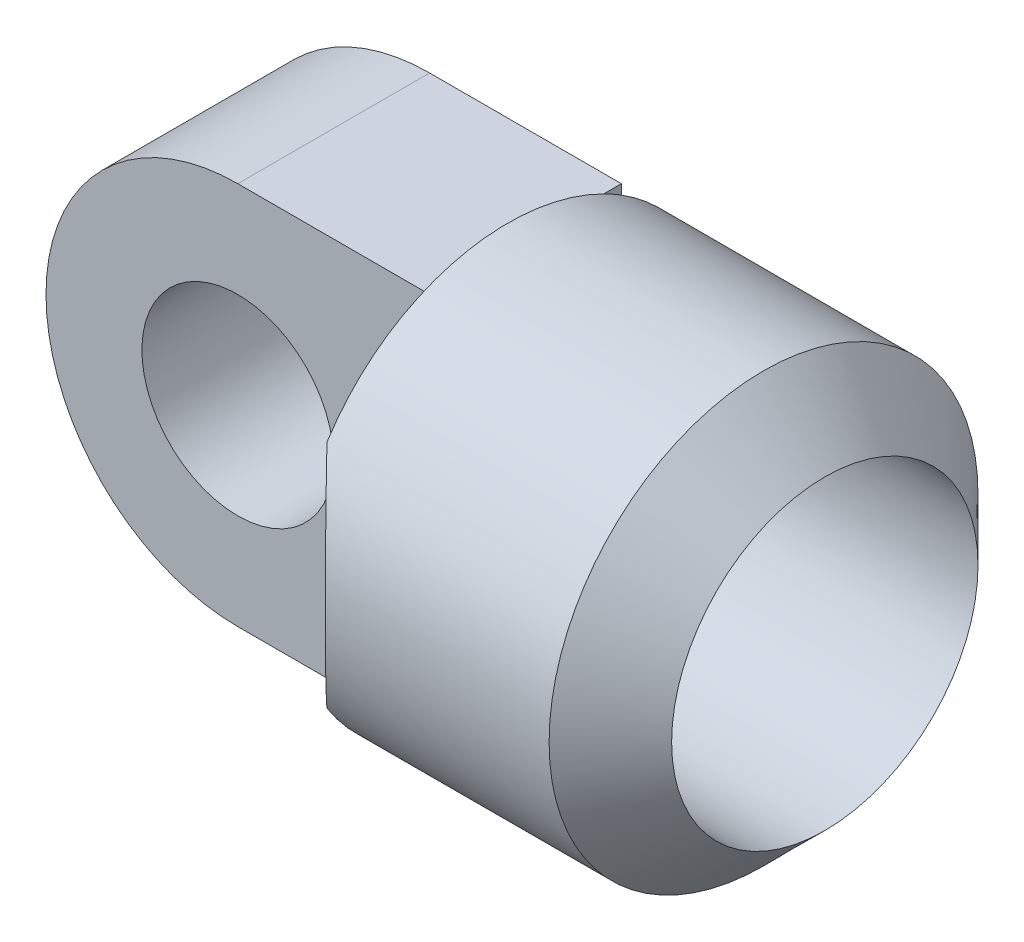
ISO-10303-21;
HEADER;
FILE_DESCRIPTION(('STEP AP214'),'2;1');
FILE_NAME('part.step','',(''),(''),'','','');
FILE_SCHEMA(('AUTOMOTIVE_DESIGN { 1 0 10303 214 1 1 1 1 }'));
ENDSEC;
DATA;
#1=APPLICATION_CONTEXT('core data for automotive mechanical design processes');
#2=APPLICATION_PROTOCOL_DEFINITION('international standard','automotive_design',2000,#1);
#3=PRODUCT_CONTEXT('',#1,'mechanical');
#4=PRODUCT('Part','Part','',(#3));
#5=PRODUCT_RELATED_PRODUCT_CATEGORY('part','',(#4));
#6=PRODUCT_DEFINITION_FORMATION('','',#4);
#7=PRODUCT_DEFINITION_CONTEXT('part definition',#1,'design');
#8=PRODUCT_DEFINITION('design','',#6,#7);
#9=PRODUCT_DEFINITION_SHAPE('','',#8);
#10=(LENGTH_UNIT() NAMED_UNIT(*) SI_UNIT(.MILLI.,.METRE.));
#11=(NAMED_UNIT(*) PLANE_ANGLE_UNIT() SI_UNIT($,.RADIAN.));
#12=(NAMED_UNIT(*) SI_UNIT($,.STERADIAN.) SOLID_ANGLE_UNIT());
#13=UNCERTAINTY_MEASURE_WITH_UNIT(LENGTH_MEASURE(1.E-05),#10,'distance_accuracy_value','');
#14=(GEOMETRIC_REPRESENTATION_CONTEXT(3) GLOBAL_UNCERTAINTY_ASSIGNED_CONTEXT((#13)) GLOBAL_UNIT_ASSIGNED_CONTEXT((#10,
#11,#12)) REPRESENTATION_CONTEXT('',''));
#15=CARTESIAN_POINT('',(0.,0.,0.));
#16=DIRECTION('',(0.,0.,1.));
#17=DIRECTION('',(1.,0.,0.));
#18=AXIS2_PLACEMENT_3D('',#15,#16,#17);
#19=CARTESIAN_POINT('',(-7.99719,0.,-5.73077001430538));
#20=DIRECTION('',(0.,0.,1.));
#21=DIRECTION('',(0.,-1.,0.));
#22=AXIS2_PLACEMENT_3D('',#19,#20,#21);
#23=CYLINDRICAL_SURFACE('',#22,4.8387);
#24=CARTESIAN_POINT('',(-7.99719,0.,3.94662998569462));
#25=DIRECTION('',(0.,0.,1.));
#26=DIRECTION('',(0.,-1.,0.));
#27=AXIS2_PLACEMENT_3D('',#24,#25,#26);
#28=CIRCLE('',#27,4.8387);
#29=CARTESIAN_POINT('',(-7.99719,-4.83870000000005,3.94662998569462));
#30=VERTEX_POINT('',#29);
#31=EDGE_CURVE('E106',#30,#30,#28,.F.);
#32=ORIENTED_EDGE('',*,*,#31,.F.);
#33=EDGE_LOOP('',(#32));
#34=FACE_BOUND('',#33,.T.);
#35=CARTESIAN_POINT('',(-7.99719,0.,-5.73077001430538));
#36=DIRECTION('',(0.,0.,1.));
#37=DIRECTION('',(0.,-1.,0.));
#38=AXIS2_PLACEMENT_3D('',#35,#36,#37);
#39=CIRCLE('',#38,4.8387);
#40=CARTESIAN_POINT('',(-7.99719,-4.83870000000005,-5.73077001430538));
#41=VERTEX_POINT('',#40);
#42=EDGE_CURVE('E19',#41,#41,#39,.F.);
#43=ORIENTED_EDGE('',*,*,#42,.T.);
#44=EDGE_LOOP('',(#43));
#45=FACE_BOUND('',#44,.T.);
#46=ADVANCED_FACE('F16',(#34,#45),#23,.F.);
#47=CARTESIAN_POINT('',(-7.99719,0.,-5.73077001430538));
#48=DIRECTION('',(0.,0.,1.));
#49=DIRECTION('',(0.,-1.,0.));
#50=AXIS2_PLACEMENT_3D('',#47,#48,#49);
#51=CYLINDRICAL_SURFACE('',#50,9.6774);
#52=CARTESIAN_POINT('',(-7.99719,0.,-5.73077001430538));
#53=DIRECTION('',(0.,0.,1.));
#54=DIRECTION('',(0.,-1.,0.));
#55=AXIS2_PLACEMENT_3D('',#52,#53,#54);
#56=CIRCLE('',#55,9.6774);
#57=CARTESIAN_POINT('',(-7.99719,9.67739999999996,-5.73077001430538));
#58=VERTEX_POINT('',#57);
#59=CARTESIAN_POINT('',(-7.99718999999999,-9.67740000000005,-5.73077001430538));
#60=VERTEX_POINT('',#59);
#61=EDGE_CURVE('E85',#58,#60,#56,.T.);
#62=ORIENTED_EDGE('',*,*,#61,.T.);
#63=DIRECTION('',(0.,0.,1.));
#64=VECTOR('',#63,1.);
#65=CARTESIAN_POINT('',(-7.99719,-9.67740000000005,-5.73077001430538));
#66=LINE('',#65,#64);
#67=CARTESIAN_POINT('',(-7.99718999999999,-9.67740000000005,3.94662998569462));
#68=VERTEX_POINT('',#67);
#69=EDGE_CURVE('E125',#68,#60,#66,.F.);
#70=ORIENTED_EDGE('',*,*,#69,.F.);
#71=CARTESIAN_POINT('',(-7.99719,0.,3.94662998569462));
#72=DIRECTION('',(0.,0.,1.));
#73=DIRECTION('',(0.,-1.,0.));
#74=AXIS2_PLACEMENT_3D('',#71,#72,#73);
#75=CIRCLE('',#74,9.6774);
#76=CARTESIAN_POINT('',(-7.99719,9.67739999999997,3.94662998569462));
#77=VERTEX_POINT('',#76);
#78=EDGE_CURVE('E102',#77,#68,#75,.T.);
#79=ORIENTED_EDGE('',*,*,#78,.F.);
#80=DIRECTION('',(0.,0.,1.));
#81=VECTOR('',#80,1.);
#82=CARTESIAN_POINT('',(-7.99719,9.67739999999996,-5.73077001430538));
#83=LINE('',#82,#81);
#84=EDGE_CURVE('E100',#58,#77,#83,.T.);
#85=ORIENTED_EDGE('',*,*,#84,.F.);
#86=EDGE_LOOP('',(#62,#70,#79,#85));
#87=FACE_BOUND('',#86,.T.);
#88=ADVANCED_FACE('F101',(#87),#51,.T.);
#89=CARTESIAN_POINT('',(-6.37543953619316,0.,-5.73077001430538));
#90=DIRECTION('',(0.,0.,1.));
#91=DIRECTION('',(0.,-1.,0.));
#92=AXIS2_PLACEMENT_3D('',#89,#90,#91);
#93=PLANE('',#92);
#94=DIRECTION('',(0.,1.,0.));
#95=VECTOR('',#94,1.);
#96=CARTESIAN_POINT('',(1.68021000000001,9.67739999999998,-5.73077001430538));
#97=LINE('',#96,#95);
#98=CARTESIAN_POINT('',(1.68020999999995,-9.67740000000004,-5.73077001430538));
#99=VERTEX_POINT('',#98);
#100=CARTESIAN_POINT('',(1.68021,-9.17819869054592,-5.73077001430538));
#101=VERTEX_POINT('',#100);
#102=EDGE_CURVE('E264',#99,#101,#97,.T.);
#103=ORIENTED_EDGE('',*,*,#102,.F.);
#104=DIRECTION('',(1.,0.,0.));
#105=VECTOR('',#104,1.);
#106=CARTESIAN_POINT('',(1.68020999999992,-9.67740000000004,-5.73077001430538));
#107=LINE('',#106,#105);
#108=EDGE_CURVE('E94',#60,#99,#107,.T.);
#109=ORIENTED_EDGE('',*,*,#108,.F.);
#110=ORIENTED_EDGE('',*,*,#61,.F.);
#111=DIRECTION('',(1.,0.,0.));
#112=VECTOR('',#111,1.);
#113=CARTESIAN_POINT('',(-7.99719,9.67739999999996,-5.73077001430538));
#114=LINE('',#113,#112);
#115=CARTESIAN_POINT('',(1.68021000000001,9.67739999999998,-5.73077001430538));
#116=VERTEX_POINT('',#115);
#117=EDGE_CURVE('E91',#116,#58,#114,.F.);
#118=ORIENTED_EDGE('',*,*,#117,.F.);
#119=DIRECTION('',(0.,-1.,0.));
#120=VECTOR('',#119,1.);
#121=CARTESIAN_POINT('',(1.68021000000001,0.,-5.73077001430538));
#122=LINE('',#121,#120);
#123=CARTESIAN_POINT('',(1.68020999999996,9.17819869054587,-5.73077001430538));
#124=VERTEX_POINT('',#123);
#125=EDGE_CURVE('E98',#124,#116,#122,.F.);
#126=ORIENTED_EDGE('',*,*,#125,.F.);
#127=DIRECTION('',(0.,1.,0.));
#128=VECTOR('',#127,1.);
#129=CARTESIAN_POINT('',(1.68021000000001,5.41019999999998,-5.73077001430538));
#130=LINE('',#129,#128);
#131=CARTESIAN_POINT('',(1.68021000000001,5.81539365219581,-5.73077001430538));
#132=VERTEX_POINT('',#131);
#133=EDGE_CURVE('E253',#132,#124,#130,.T.);
#134=ORIENTED_EDGE('',*,*,#133,.F.);
#135=CARTESIAN_POINT('',(-7.99719,0.,-5.73077001430538));
#136=DIRECTION('',(0.,0.,1.));
#137=DIRECTION('',(0.,-1.,0.));
#138=AXIS2_PLACEMENT_3D('',#135,#136,#137);
#139=CIRCLE('',#138,11.2903);
#140=CARTESIAN_POINT('',(1.68021000000001,-5.81539365219591,-5.73077001430538));
#141=VERTEX_POINT('',#140);
#142=EDGE_CURVE('E216',#132,#141,#139,.F.);
#143=ORIENTED_EDGE('',*,*,#142,.T.);
#144=DIRECTION('',(0.,1.,0.));
#145=VECTOR('',#144,1.);
#146=CARTESIAN_POINT('',(1.68021000000001,5.41019999999998,-5.73077001430538));
#147=LINE('',#146,#145);
#148=EDGE_CURVE('E219',#101,#141,#147,.T.);
#149=ORIENTED_EDGE('',*,*,#148,.F.);
#150=EDGE_LOOP('',(#103,#109,#110,#118,#126,#134,#143,#149));
#151=FACE_BOUND('',#150,.T.);
#152=ORIENTED_EDGE('',*,*,#42,.F.);
#153=EDGE_LOOP('',(#152));
#154=FACE_BOUND('',#153,.T.);
#155=ADVANCED_FACE('F88',(#151,#154),#93,.F.);
#156=CARTESIAN_POINT('',(4.90600999999998,3.86460999999999,0.));
#157=DIRECTION('',(1.,0.,0.));
#158=DIRECTION('',(0.,1.,0.));
#159=AXIS2_PLACEMENT_3D('',#156,#157,#158);
#160=PLANE('',#159);
#161=CARTESIAN_POINT('',(4.90600999999998,0.,0.));
#162=DIRECTION('',(1.,0.,0.));
#163=DIRECTION('',(0.,0.,-1.));
#164=AXIS2_PLACEMENT_3D('',#161,#162,#163);
#165=CIRCLE('',#164,7.72922000000001);
#166=CARTESIAN_POINT('',(4.90600999999998,0.,-7.72922000000001));
#167=VERTEX_POINT('',#166);
#168=EDGE_CURVE('E220',#167,#167,#165,.F.);
#169=ORIENTED_EDGE('',*,*,#168,.F.);
#170=EDGE_LOOP('',(#169));
#171=FACE_BOUND('',#170,.T.);
#172=ADVANCED_FACE('F192',(#171),#160,.T.);
#173=CARTESIAN_POINT('',(-7.99719,9.67739999999996,-5.73077001430538));
#174=DIRECTION('',(0.,1.,0.));
#175=DIRECTION('',(0.,0.,1.));
#176=AXIS2_PLACEMENT_3D('',#173,#174,#175);
#177=PLANE('',#176);
#178=ORIENTED_EDGE('',*,*,#117,.T.);
#179=ORIENTED_EDGE('',*,*,#84,.T.);
#180=DIRECTION('',(1.,0.,0.));
#181=VECTOR('',#180,1.);
#182=CARTESIAN_POINT('',(-6.37543953619316,9.67739999999998,3.94662998569462));
#183=LINE('',#182,#181);
#184=CARTESIAN_POINT('',(1.68021000000001,9.67739999999997,3.94662998569462));
#185=VERTEX_POINT('',#184);
#186=EDGE_CURVE('E211',#185,#77,#183,.F.);
#187=ORIENTED_EDGE('',*,*,#186,.F.);
#188=DIRECTION('',(0.,0.,1.));
#189=VECTOR('',#188,1.);
#190=CARTESIAN_POINT('',(1.68021000000001,9.67739999999996,0.));
#191=LINE('',#190,#189);
#192=CARTESIAN_POINT('',(1.68021000000001,9.67739999999997,-4.84034971877036));
#193=VERTEX_POINT('',#192);
#194=EDGE_CURVE('E223',#193,#185,#191,.T.);
#195=ORIENTED_EDGE('',*,*,#194,.F.);
#196=DIRECTION('',(0.,0.,1.));
#197=VECTOR('',#196,1.);
#198=CARTESIAN_POINT('',(1.68021000000001,9.67739999999998,-5.73077001430538));
#199=LINE('',#198,#197);
#200=EDGE_CURVE('E111',#116,#193,#199,.T.);
#201=ORIENTED_EDGE('',*,*,#200,.F.);
#202=EDGE_LOOP('',(#178,#179,#187,#195,#201));
#203=FACE_BOUND('',#202,.T.);
#204=ADVANCED_FACE('F108',(#203),#177,.T.);
#205=CARTESIAN_POINT('',(-6.37543953619316,0.,3.94662998569462));
#206=DIRECTION('',(0.,0.,1.));
#207=DIRECTION('',(0.,-1.,0.));
#208=AXIS2_PLACEMENT_3D('',#205,#206,#207);
#209=PLANE('',#208);
#210=DIRECTION('',(0.,1.,0.));
#211=VECTOR('',#210,1.);
#212=CARTESIAN_POINT('',(1.68021000000001,5.41019999999998,3.94662998569462));
#213=LINE('',#212,#211);
#214=CARTESIAN_POINT('',(1.68021000000001,-5.81539365219592,3.94662998569462));
#215=VERTEX_POINT('',#214);
#216=CARTESIAN_POINT('',(1.68021000000001,-9.67740000000004,3.94662998569462));
#217=VERTEX_POINT('',#216);
#218=EDGE_CURVE('E233',#215,#217,#213,.F.);
#219=ORIENTED_EDGE('',*,*,#218,.F.);
#220=CARTESIAN_POINT('',(-7.99719,0.,3.94662998569462));
#221=DIRECTION('',(0.,0.,1.));
#222=DIRECTION('',(0.,-1.,0.));
#223=AXIS2_PLACEMENT_3D('',#220,#221,#222);
#224=CIRCLE('',#223,11.2903);
#225=CARTESIAN_POINT('',(1.68021000000001,5.81539365219582,3.94662998569462));
#226=VERTEX_POINT('',#225);
#227=EDGE_CURVE('E224',#215,#226,#224,.T.);
#228=ORIENTED_EDGE('',*,*,#227,.T.);
#229=DIRECTION('',(0.,1.,0.));
#230=VECTOR('',#229,1.);
#231=CARTESIAN_POINT('',(1.68021000000001,5.41019999999998,3.94662998569462));
#232=LINE('',#231,#230);
#233=EDGE_CURVE('E226',#185,#226,#232,.F.);
#234=ORIENTED_EDGE('',*,*,#233,.F.);
#235=ORIENTED_EDGE('',*,*,#186,.T.);
#236=ORIENTED_EDGE('',*,*,#78,.T.);
#237=DIRECTION('',(1.,0.,0.));
#238=VECTOR('',#237,1.);
#239=CARTESIAN_POINT('',(1.68020999999992,-9.67740000000004,3.94662998569462));
#240=LINE('',#239,#238);
#241=EDGE_CURVE('E128',#217,#68,#240,.F.);
#242=ORIENTED_EDGE('',*,*,#241,.F.);
#243=EDGE_LOOP('',(#219,#228,#234,#235,#236,#242));
#244=FACE_BOUND('',#243,.T.);
#245=ORIENTED_EDGE('',*,*,#31,.T.);
#246=EDGE_LOOP('',(#245));
#247=FACE_BOUND('',#246,.T.);
#248=ADVANCED_FACE('F185',(#244,#247),#209,.T.);
#249=CARTESIAN_POINT('',(1.68020999999992,-9.67740000000004,-5.73077001430538));
#250=DIRECTION('',(0.,-1.,0.));
#251=DIRECTION('',(1.,0.,0.));
#252=AXIS2_PLACEMENT_3D('',#249,#250,#251);
#253=PLANE('',#252);
#254=DIRECTION('',(0.,0.,1.));
#255=VECTOR('',#254,1.);
#256=CARTESIAN_POINT('',(1.68020999999996,-9.67740000000004,-5.73077001430538));
#257=LINE('',#256,#255);
#258=CARTESIAN_POINT('',(1.68020999999999,-9.67740000000004,-4.84034971877031));
#259=VERTEX_POINT('',#258);
#260=EDGE_CURVE('E124',#259,#99,#257,.F.);
#261=ORIENTED_EDGE('',*,*,#260,.F.);
#262=DIRECTION('',(0.,0.,1.));
#263=VECTOR('',#262,1.);
#264=CARTESIAN_POINT('',(1.68021000000001,-9.67740000000004,0.));
#265=LINE('',#264,#263);
#266=EDGE_CURVE('E229',#217,#259,#265,.F.);
#267=ORIENTED_EDGE('',*,*,#266,.F.);
#268=ORIENTED_EDGE('',*,*,#241,.T.);
#269=ORIENTED_EDGE('',*,*,#69,.T.);
#270=ORIENTED_EDGE('',*,*,#108,.T.);
#271=EDGE_LOOP('',(#261,#267,#268,#269,#270));
#272=FACE_BOUND('',#271,.T.);
#273=ADVANCED_FACE('F181',(#272),#253,.T.);
#274=CARTESIAN_POINT('',(1.68021000000001,9.67739999999998,-5.73077001430538));
#275=DIRECTION('',(1.,0.,0.));
#276=DIRECTION('',(0.,1.,0.));
#277=AXIS2_PLACEMENT_3D('',#274,#275,#276);
#278=PLANE('',#277);
#279=ORIENTED_EDGE('',*,*,#260,.T.);
#280=ORIENTED_EDGE('',*,*,#102,.T.);
#281=CARTESIAN_POINT('',(1.68021000000001,0.,0.));
#282=DIRECTION('',(1.,0.,0.));
#283=DIRECTION('',(0.,0.,-1.));
#284=AXIS2_PLACEMENT_3D('',#281,#282,#283);
#285=CIRCLE('',#284,10.8204);
#286=EDGE_CURVE('E227',#259,#101,#285,.T.);
#287=ORIENTED_EDGE('',*,*,#286,.F.);
#288=EDGE_LOOP('',(#279,#280,#287));
#289=FACE_BOUND('',#288,.T.);
#290=ADVANCED_FACE('F177',(#289),#278,.T.);
#291=CARTESIAN_POINT('',(1.68021000000001,5.41019999999998,0.));
#292=DIRECTION('',(-1.,0.,0.));
#293=DIRECTION('',(0.,0.,1.));
#294=AXIS2_PLACEMENT_3D('',#291,#292,#293);
#295=PLANE('',#294);
#296=CARTESIAN_POINT('',(1.68021000000001,0.,0.));
#297=DIRECTION('',(1.,0.,0.));
#298=DIRECTION('',(0.,0.,-1.));
#299=AXIS2_PLACEMENT_3D('',#296,#297,#298);
#300=CIRCLE('',#299,10.8204);
#301=CARTESIAN_POINT('',(1.68021000000001,-5.81539365219591,-9.12481522169079));
#302=VERTEX_POINT('',#301);
#303=EDGE_CURVE('E164',#101,#302,#300,.T.);
#304=ORIENTED_EDGE('',*,*,#303,.F.);
#305=ORIENTED_EDGE('',*,*,#148,.T.);
#306=DIRECTION('',(0.,0.,1.));
#307=VECTOR('',#306,1.);
#308=CARTESIAN_POINT('',(1.68021000000002,-5.8153936521959,-19.4277460844386));
#309=LINE('',#308,#307);
#310=EDGE_CURVE('E218',#141,#302,#309,.F.);
#311=ORIENTED_EDGE('',*,*,#310,.T.);
#312=EDGE_LOOP('',(#304,#305,#311));
#313=FACE_BOUND('',#312,.T.);
#314=ADVANCED_FACE('F172',(#313),#295,.T.);
#315=CARTESIAN_POINT('',(-7.99719,0.,-19.4277460844386));
#316=DIRECTION('',(0.,0.,1.));
#317=DIRECTION('',(0.,-1.,0.));
#318=AXIS2_PLACEMENT_3D('',#315,#316,#317);
#319=CYLINDRICAL_SURFACE('',#318,11.2903);
#320=ORIENTED_EDGE('',*,*,#142,.F.);
#321=DIRECTION('',(0.,0.,1.));
#322=VECTOR('',#321,1.);
#323=CARTESIAN_POINT('',(1.68021000000001,5.8153936521958,0.));
#324=LINE('',#323,#322);
#325=CARTESIAN_POINT('',(1.68020999999996,5.81539365219589,-9.12481522169077));
#326=VERTEX_POINT('',#325);
#327=EDGE_CURVE('E258',#326,#132,#324,.T.);
#328=ORIENTED_EDGE('',*,*,#327,.F.);
#329=CARTESIAN_POINT('',(1.68021000000001,-5.81539365219592,-9.12481522169079));
#330=CARTESIAN_POINT('',(1.79494687211573,-5.62447881934593,-9.24649654977026));
#331=CARTESIAN_POINT('',(1.90541605318246,-5.42782978514815,-9.36338931510067));
#332=CARTESIAN_POINT('',(2.11664208448603,-5.02328023236091,-9.58650577800547));
#333=CARTESIAN_POINT('',(2.21738928168013,-4.81536884459275,-9.69271887594788));
#334=CARTESIAN_POINT('',(2.40842913961369,-4.38739791752312,-9.89384057644339));
#335=CARTESIAN_POINT('',(2.4986438026222,-4.16726362276936,-9.98866497314407));
#336=CARTESIAN_POINT('',(2.66640253142224,-3.71703555885284,-10.1647975349523));
#337=CARTESIAN_POINT('',(2.74395020565476,-3.48694464973567,-10.2461095494428));
#338=CARTESIAN_POINT('',(2.88550199041471,-3.01639139394401,-10.3944051519695));
#339=CARTESIAN_POINT('',(2.94941851959497,-2.77587326285415,-10.4612961116752));
#340=CARTESIAN_POINT('',(3.06182498980503,-2.28733030020085,-10.5788605968069));
#341=CARTESIAN_POINT('',(3.11031372809897,-2.03930488502656,-10.6295328578406));
#342=CARTESIAN_POINT('',(3.19064984859749,-1.53856486992551,-10.7134536596122));
#343=CARTESIAN_POINT('',(3.22255475707064,-1.28586967140463,-10.7467624322876));
#344=CARTESIAN_POINT('',(3.26922178405908,-0.77720094651681,-10.7954743195461));
#345=CARTESIAN_POINT('',(3.2839862097192,-0.521227866050149,-10.8108798439441));
#346=CARTESIAN_POINT('',(3.29540759812416,-0.034567733242992,-10.8227974313853));
#347=CARTESIAN_POINT('',(3.29375554843121,0.196039561830917,-10.8210738812071));
#348=CARTESIAN_POINT('',(3.27637860669164,0.656132547875239,-10.8029411792925));
#349=CARTESIAN_POINT('',(3.26065460449098,0.885618308843755,-10.7865329561476));
#350=CARTESIAN_POINT('',(3.21542414495728,1.34193191943411,-10.7393176585997));
#351=CARTESIAN_POINT('',(3.1859051855501,1.56875716634255,-10.7084975229735));
#352=CARTESIAN_POINT('',(3.11364041026019,2.01793739670683,-10.6330077367667));
#353=CARTESIAN_POINT('',(3.07089460724757,2.24029238451213,-10.588338099662));
#354=CARTESIAN_POINT('',(2.97443253671281,2.67243107826348,-10.4874636525454));
#355=CARTESIAN_POINT('',(2.92109128201766,2.88239131461657,-10.4316529012329));
#356=CARTESIAN_POINT('',(2.80348115532811,3.29584479247739,-10.3084923069296));
#357=CARTESIAN_POINT('',(2.73920790287775,3.49933540265525,-10.2411378382835));
#358=CARTESIAN_POINT('',(2.60066627119722,3.89884648259149,-10.0958021834679));
#359=CARTESIAN_POINT('',(2.52640247300809,4.0948703235927,-10.0178258676101));
#360=CARTESIAN_POINT('',(2.36875742997701,4.4789630666063,-9.85209123433805));
#361=CARTESIAN_POINT('',(2.28537529591464,4.66703119029225,-9.76433196287336));
#362=CARTESIAN_POINT('',(2.11790463437338,5.01900357314238,-9.58780654264556));
#363=CARTESIAN_POINT('',(2.0344887712878,5.18359755778353,-9.49977093847614));
#364=CARTESIAN_POINT('',(1.86169329101056,5.50513657657413,-9.3171147626233));
#365=CARTESIAN_POINT('',(1.77233062673362,5.66210131840419,-9.22251287925035));
#366=CARTESIAN_POINT('',(1.68021000000001,5.81539365219583,-9.12481522169081));
#367=B_SPLINE_CURVE_WITH_KNOTS('',3,(#329,#330,#331,#332,#333,#334,#335,#336,#337,#338,#339,
#340,#341,#342,#343,#344,#345,#346,#347,#348,#349,#350,#351,#352,#353,#354,#355,#356,#357,#358,
#359,#360,#361,#362,#363,#364,#365,#366),.UNSPECIFIED.,.F.,.F.,(4,2,2,2,2,2,2,2,2,2,2,2,2,2,2,2,
2,2,4),(0.,0.76141554437509,1.52357948940406,2.29107083210709,3.0583431570605,3.83040590440519,
4.60252882628603,5.37195521416869,6.14127802363821,6.83225039523386,7.52317907598193,
8.21473514854322,8.90629054820281,9.57672043898905,10.2474196069335,10.9178122757196,
11.5882703796202,12.2012824189608,12.8126161442915),.UNSPECIFIED.);
#368=EDGE_CURVE('E154',#302,#326,#367,.T.);
#369=ORIENTED_EDGE('',*,*,#368,.F.);
#370=ORIENTED_EDGE('',*,*,#310,.F.);
#371=EDGE_LOOP('',(#320,#328,#369,#370));
#372=FACE_BOUND('',#371,.T.);
#373=ADVANCED_FACE('F166',(#372),#319,.F.);
#374=CARTESIAN_POINT('',(1.68021000000001,5.41019999999998,0.));
#375=DIRECTION('',(-1.,0.,0.));
#376=DIRECTION('',(0.,0.,1.));
#377=AXIS2_PLACEMENT_3D('',#374,#375,#376);
#378=PLANE('',#377);
#379=ORIENTED_EDGE('',*,*,#133,.T.);
#380=CARTESIAN_POINT('',(1.68020999999992,0.,0.));
#381=DIRECTION('',(1.,0.,0.));
#382=DIRECTION('',(0.,0.,-1.));
#383=AXIS2_PLACEMENT_3D('',#380,#381,#382);
#384=CIRCLE('',#383,10.8204);
#385=EDGE_CURVE('E163',#326,#124,#384,.T.);
#386=ORIENTED_EDGE('',*,*,#385,.F.);
#387=ORIENTED_EDGE('',*,*,#327,.T.);
#388=EDGE_LOOP('',(#379,#386,#387));
#389=FACE_BOUND('',#388,.T.);
#390=ADVANCED_FACE('F171',(#389),#378,.T.);
#391=CARTESIAN_POINT('',(1.68021000000001,9.67739999999998,-5.73077001430538));
#392=DIRECTION('',(1.,0.,0.));
#393=DIRECTION('',(0.,1.,0.));
#394=AXIS2_PLACEMENT_3D('',#391,#392,#393);
#395=PLANE('',#394);
#396=ORIENTED_EDGE('',*,*,#125,.T.);
#397=ORIENTED_EDGE('',*,*,#200,.T.);
#398=CARTESIAN_POINT('',(1.68021000000001,0.,0.));
#399=DIRECTION('',(1.,0.,0.));
#400=DIRECTION('',(0.,0.,-1.));
#401=AXIS2_PLACEMENT_3D('',#398,#399,#400);
#402=CIRCLE('',#401,10.8204);
#403=EDGE_CURVE('E251',#124,#193,#402,.T.);
#404=ORIENTED_EDGE('',*,*,#403,.F.);
#405=EDGE_LOOP('',(#396,#397,#404));
#406=FACE_BOUND('',#405,.T.);
#407=ADVANCED_FACE('F292',(#406),#395,.T.);
#408=CARTESIAN_POINT('',(4.90600999999998,0.,0.));
#409=DIRECTION('',(1.,0.,0.));
#410=DIRECTION('',(0.,0.,-1.));
#411=AXIS2_PLACEMENT_3D('',#408,#409,#410);
#412=CYLINDRICAL_SURFACE('',#411,7.72922000000001);
#413=CARTESIAN_POINT('',(17.67459,0.,0.));
#414=DIRECTION('',(-1.,0.,0.));
#415=DIRECTION('',(0.,1.,0.));
#416=AXIS2_PLACEMENT_3D('',#413,#414,#415);
#417=CIRCLE('',#416,7.72921999999999);
#418=CARTESIAN_POINT('',(17.67459,7.72921999999996,0.));
#419=VERTEX_POINT('',#418);
#420=EDGE_CURVE('E248',#419,#419,#417,.T.);
#421=ORIENTED_EDGE('',*,*,#420,.F.);
#422=EDGE_LOOP('',(#421));
#423=FACE_BOUND('',#422,.T.);
#424=ORIENTED_EDGE('',*,*,#168,.T.);
#425=EDGE_LOOP('',(#424));
#426=FACE_BOUND('',#425,.T.);
#427=ADVANCED_FACE('F313',(#423,#426),#412,.F.);
#428=CARTESIAN_POINT('',(1.68021000000001,5.41019999999998,0.));
#429=DIRECTION('',(-1.,0.,0.));
#430=DIRECTION('',(0.,0.,1.));
#431=AXIS2_PLACEMENT_3D('',#428,#429,#430);
#432=PLANE('',#431);
#433=ORIENTED_EDGE('',*,*,#194,.T.);
#434=ORIENTED_EDGE('',*,*,#233,.T.);
#435=DIRECTION('',(0.,0.,1.));
#436=VECTOR('',#435,1.);
#437=CARTESIAN_POINT('',(1.68021000000002,5.81539365219581,3.94662998569462));
#438=LINE('',#437,#436);
#439=CARTESIAN_POINT('',(1.68021000000001,5.81539365219582,9.12481522169082));
#440=VERTEX_POINT('',#439);
#441=EDGE_CURVE('E225',#226,#440,#438,.T.);
#442=ORIENTED_EDGE('',*,*,#441,.T.);
#443=CARTESIAN_POINT('',(1.68021000000001,0.,0.));
#444=DIRECTION('',(1.,0.,0.));
#445=DIRECTION('',(0.,0.,-1.));
#446=AXIS2_PLACEMENT_3D('',#443,#444,#445);
#447=CIRCLE('',#446,10.8204);
#448=EDGE_CURVE('E140',#193,#440,#447,.T.);
#449=ORIENTED_EDGE('',*,*,#448,.F.);
#450=EDGE_LOOP('',(#433,#434,#442,#449));
#451=FACE_BOUND('',#450,.T.);
#452=ADVANCED_FACE('F284',(#451),#432,.T.);
#453=CARTESIAN_POINT('',(-7.99719,0.,3.94662998569462));
#454=DIRECTION('',(0.,0.,1.));
#455=DIRECTION('',(0.,-1.,0.));
#456=AXIS2_PLACEMENT_3D('',#453,#454,#455);
#457=CYLINDRICAL_SURFACE('',#456,11.2903);
#458=ORIENTED_EDGE('',*,*,#227,.F.);
#459=DIRECTION('',(0.,0.,1.));
#460=VECTOR('',#459,1.);
#461=CARTESIAN_POINT('',(1.68021000000001,-5.81539365219592,0.));
#462=LINE('',#461,#460);
#463=CARTESIAN_POINT('',(1.68021000000001,-5.81539365219592,9.12481522169078));
#464=VERTEX_POINT('',#463);
#465=EDGE_CURVE('E34',#464,#215,#462,.F.);
#466=ORIENTED_EDGE('',*,*,#465,.F.);
#467=CARTESIAN_POINT('',(1.68021,5.81539365219583,9.12481522169081));
#468=CARTESIAN_POINT('',(1.79494687211573,5.62447881934585,9.24649654977029));
#469=CARTESIAN_POINT('',(1.90541605318246,5.42782978514806,9.36338931510069));
#470=CARTESIAN_POINT('',(2.11664208448602,5.02328023236083,9.58650577800549));
#471=CARTESIAN_POINT('',(2.21738928168013,4.81536884459266,9.6927188759479));
#472=CARTESIAN_POINT('',(2.40842913961369,4.38739791752304,9.89384057644341));
#473=CARTESIAN_POINT('',(2.49864380262219,4.16726362276927,9.98866497314409));
#474=CARTESIAN_POINT('',(2.66640253142224,3.71703555885276,10.1647975349523));
#475=CARTESIAN_POINT('',(2.74395020565475,3.48694464973559,10.2461095494428));
#476=CARTESIAN_POINT('',(2.88550199041471,3.01639139394392,10.3944051519695));
#477=CARTESIAN_POINT('',(2.94941851959497,2.77587326285407,10.4612961116752));
#478=CARTESIAN_POINT('',(3.06182498980503,2.28733030020077,10.578860596807));
#479=CARTESIAN_POINT('',(3.11031372809897,2.03930488502648,10.6295328578406));
#480=CARTESIAN_POINT('',(3.19064984859749,1.53856486992543,10.7134536596123));
#481=CARTESIAN_POINT('',(3.22255475707064,1.28586967140455,10.7467624322876));
#482=CARTESIAN_POINT('',(3.26922178405908,0.77720094651673,10.7954743195461));
#483=CARTESIAN_POINT('',(3.2839862097192,0.52122786605007,10.8108798439441));
#484=CARTESIAN_POINT('',(3.29540759812416,0.0345677332429126,10.8227974313853));
#485=CARTESIAN_POINT('',(3.29375554843121,-0.196039561830997,10.8210738812071));
#486=CARTESIAN_POINT('',(3.27637860669164,-0.656132547875319,10.8029411792924));
#487=CARTESIAN_POINT('',(3.26065460449098,-0.885618308843834,10.7865329561476));
#488=CARTESIAN_POINT('',(3.21542414495728,-1.34193191943419,10.7393176585996));
#489=CARTESIAN_POINT('',(3.1859051855501,-1.56875716634263,10.7084975229735));
#490=CARTESIAN_POINT('',(3.11364041026019,-2.01793739670691,10.6330077367667));
#491=CARTESIAN_POINT('',(3.07089460724757,-2.24029238451221,10.588338099662));
#492=CARTESIAN_POINT('',(2.97443253671282,-2.67243107826356,10.4874636525454));
#493=CARTESIAN_POINT('',(2.92109128201766,-2.88239131461665,10.4316529012329));
#494=CARTESIAN_POINT('',(2.80348115532811,-3.29584479247747,10.3084923069296));
#495=CARTESIAN_POINT('',(2.73920790287775,-3.49933540265533,10.2411378382834));
#496=CARTESIAN_POINT('',(2.60066627119723,-3.89884648259157,10.0958021834678));
#497=CARTESIAN_POINT('',(2.52640247300809,-4.09487032359279,10.0178258676101));
#498=CARTESIAN_POINT('',(2.36875742997701,-4.47896306660639,9.85209123433803));
#499=CARTESIAN_POINT('',(2.28537529591464,-4.66703119029234,9.76433196287334));
#500=CARTESIAN_POINT('',(2.11790463437339,-5.01900357314246,9.58780654264554));
#501=CARTESIAN_POINT('',(2.0344887712878,-5.18359755778361,9.49977093847612));
#502=CARTESIAN_POINT('',(1.86169329101056,-5.50513657657421,9.31711476262328));
#503=CARTESIAN_POINT('',(1.77233062673362,-5.66210131840427,9.22251287925032));
#504=CARTESIAN_POINT('',(1.68021000000001,-5.81539365219591,9.12481522169079));
#505=B_SPLINE_CURVE_WITH_KNOTS('',3,(#467,#468,#469,#470,#471,#472,#473,#474,#475,#476,#477,
#478,#479,#480,#481,#482,#483,#484,#485,#486,#487,#488,#489,#490,#491,#492,#493,#494,#495,#496,
#497,#498,#499,#500,#501,#502,#503,#504),.UNSPECIFIED.,.F.,.F.,(4,2,2,2,2,2,2,2,2,2,2,2,2,2,2,2,
2,2,4),(0.,0.761415544375089,1.52357948940406,2.29107083210709,3.05834315706049,
3.83040590440518,4.60252882628602,5.37195521416868,6.1412780236382,6.83225039523385,
7.52317907598192,8.21473514854321,8.9062905482028,9.57672043898905,10.2474196069335,
10.9178122757196,11.5882703796202,12.2012824189608,12.8126161442915),.UNSPECIFIED.);
#506=EDGE_CURVE('E131',#440,#464,#505,.T.);
#507=ORIENTED_EDGE('',*,*,#506,.F.);
#508=ORIENTED_EDGE('',*,*,#441,.F.);
#509=EDGE_LOOP('',(#458,#466,#507,#508));
#510=FACE_BOUND('',#509,.T.);
#511=ADVANCED_FACE('F142',(#510),#457,.F.);
#512=CARTESIAN_POINT('',(1.68021000000001,5.41019999999998,0.));
#513=DIRECTION('',(-1.,0.,0.));
#514=DIRECTION('',(0.,0.,1.));
#515=AXIS2_PLACEMENT_3D('',#512,#513,#514);
#516=PLANE('',#515);
#517=ORIENTED_EDGE('',*,*,#266,.T.);
#518=CARTESIAN_POINT('',(1.68021000000001,0.,0.));
#519=DIRECTION('',(1.,0.,0.));
#520=DIRECTION('',(0.,0.,-1.));
#521=AXIS2_PLACEMENT_3D('',#518,#519,#520);
#522=CIRCLE('',#521,10.8204);
#523=EDGE_CURVE('E25',#464,#259,#522,.T.);
#524=ORIENTED_EDGE('',*,*,#523,.F.);
#525=ORIENTED_EDGE('',*,*,#465,.T.);
#526=ORIENTED_EDGE('',*,*,#218,.T.);
#527=EDGE_LOOP('',(#517,#524,#525,#526));
#528=FACE_BOUND('',#527,.T.);
#529=ADVANCED_FACE('F303',(#528),#516,.T.);
#530=CARTESIAN_POINT('',(14.5834099999999,0.,0.));
#531=DIRECTION('',(-1.,0.,0.));
#532=DIRECTION('',(0.,0.,1.));
#533=AXIS2_PLACEMENT_3D('',#530,#531,#532);
#534=CONICAL_SURFACE('',#533,10.8204,0.785398163397445);
#535=CARTESIAN_POINT('',(14.5834099999999,0.,0.));
#536=DIRECTION('',(1.,0.,0.));
#537=DIRECTION('',(0.,0.,-1.));
#538=AXIS2_PLACEMENT_3D('',#535,#536,#537);
#539=CIRCLE('',#538,10.8204);
#540=CARTESIAN_POINT('',(14.5834099999999,0.,-10.8204));
#541=VERTEX_POINT('',#540);
#542=EDGE_CURVE('E11',#541,#541,#539,.F.);
#543=ORIENTED_EDGE('',*,*,#542,.F.);
#544=EDGE_LOOP('',(#543));
#545=FACE_BOUND('',#544,.T.);
#546=ORIENTED_EDGE('',*,*,#420,.T.);
#547=EDGE_LOOP('',(#546));
#548=FACE_BOUND('',#547,.T.);
#549=ADVANCED_FACE('F150',(#545,#548),#534,.T.);
#550=CARTESIAN_POINT('',(8.13180999999995,0.,0.));
#551=DIRECTION('',(1.,0.,0.));
#552=DIRECTION('',(0.,0.,-1.));
#553=AXIS2_PLACEMENT_3D('',#550,#551,#552);
#554=CYLINDRICAL_SURFACE('',#553,10.8204);
#555=ORIENTED_EDGE('',*,*,#403,.T.);
#556=ORIENTED_EDGE('',*,*,#448,.T.);
#557=ORIENTED_EDGE('',*,*,#506,.T.);
#558=ORIENTED_EDGE('',*,*,#523,.T.);
#559=ORIENTED_EDGE('',*,*,#286,.T.);
#560=ORIENTED_EDGE('',*,*,#303,.T.);
#561=ORIENTED_EDGE('',*,*,#368,.T.);
#562=ORIENTED_EDGE('',*,*,#385,.T.);
#563=EDGE_LOOP('',(#555,#556,#557,#558,#559,#560,#561,#562));
#564=FACE_BOUND('',#563,.T.);
#565=ORIENTED_EDGE('',*,*,#542,.T.);
#566=EDGE_LOOP('',(#565));
#567=FACE_BOUND('',#566,.T.);
#568=ADVANCED_FACE('F146',(#564,#567),#554,.T.);
#569=CLOSED_SHELL('',(#46,#88,#155,#172,#204,#248,#273,#290,#314,#373,#390,#407,#427,#452,#511,
#529,#549,#568));
#570=MANIFOLD_SOLID_BREP('B1',#569);
#571=ADVANCED_BREP_SHAPE_REPRESENTATION('',(#18,#570),#14);
#572=SHAPE_DEFINITION_REPRESENTATION(#9,#571);
ENDSEC;
END-ISO-10303-21;
